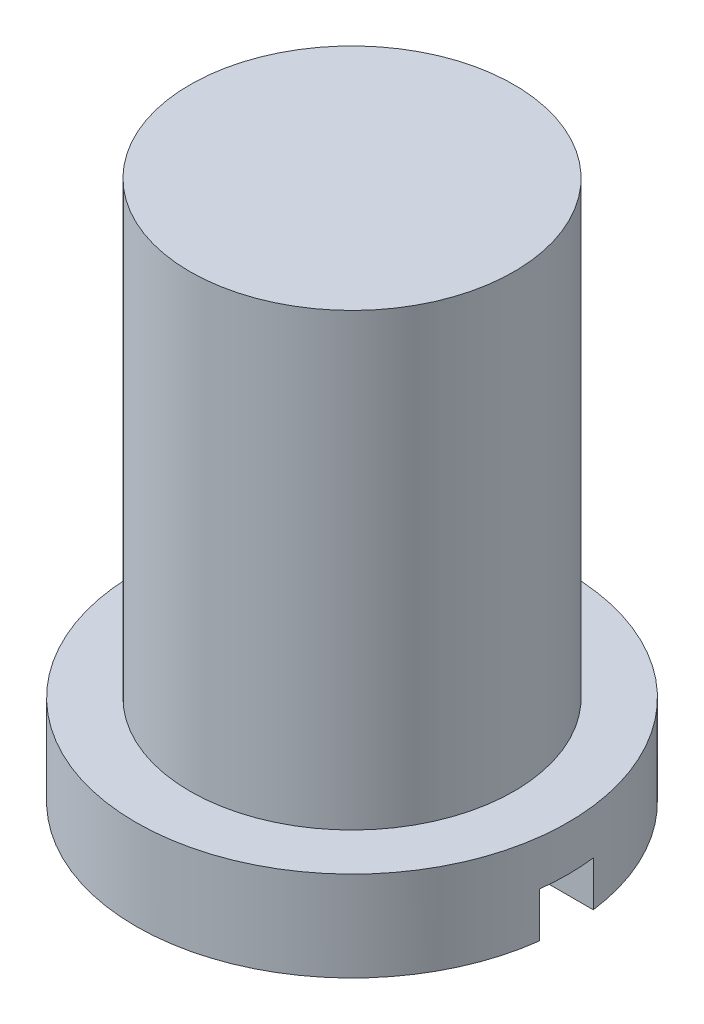
ISO-10303-21;
HEADER;
FILE_DESCRIPTION(('STEP AP214'),'2;1');
FILE_NAME('part.step','',(''),(''),'','','');
FILE_SCHEMA(('AUTOMOTIVE_DESIGN { 1 0 10303 214 1 1 1 1 }'));
ENDSEC;
DATA;
#1=APPLICATION_CONTEXT('core data for automotive mechanical design processes');
#2=APPLICATION_PROTOCOL_DEFINITION('international standard','automotive_design',2000,#1);
#3=PRODUCT_CONTEXT('',#1,'mechanical');
#4=PRODUCT('Part','Part','',(#3));
#5=PRODUCT_RELATED_PRODUCT_CATEGORY('part','',(#4));
#6=PRODUCT_DEFINITION_FORMATION('','',#4);
#7=PRODUCT_DEFINITION_CONTEXT('part definition',#1,'design');
#8=PRODUCT_DEFINITION('design','',#6,#7);
#9=PRODUCT_DEFINITION_SHAPE('','',#8);
#10=(LENGTH_UNIT() NAMED_UNIT(*) SI_UNIT(.MILLI.,.METRE.));
#11=(NAMED_UNIT(*) PLANE_ANGLE_UNIT() SI_UNIT($,.RADIAN.));
#12=(NAMED_UNIT(*) SI_UNIT($,.STERADIAN.) SOLID_ANGLE_UNIT());
#13=UNCERTAINTY_MEASURE_WITH_UNIT(LENGTH_MEASURE(1.E-05),#10,'distance_accuracy_value','');
#14=(GEOMETRIC_REPRESENTATION_CONTEXT(3) GLOBAL_UNCERTAINTY_ASSIGNED_CONTEXT((#13)) GLOBAL_UNIT_ASSIGNED_CONTEXT((#10,
#11,#12)) REPRESENTATION_CONTEXT('',''));
#15=CARTESIAN_POINT('',(0.,0.,0.));
#16=DIRECTION('',(0.,0.,1.));
#17=DIRECTION('',(1.,0.,0.));
#18=AXIS2_PLACEMENT_3D('',#15,#16,#17);
#19=CARTESIAN_POINT('',(0.,0.,0.));
#20=DIRECTION('',(0.,1.,0.));
#21=DIRECTION('',(0.,0.,1.));
#22=AXIS2_PLACEMENT_3D('',#19,#20,#21);
#23=PLANE('',#22);
#24=CARTESIAN_POINT('',(0.,0.,0.));
#25=DIRECTION('',(0.,1.,0.));
#26=DIRECTION('',(0.,0.,1.));
#27=AXIS2_PLACEMENT_3D('',#24,#25,#26);
#28=CIRCLE('',#27,2.4);
#29=CARTESIAN_POINT('',(-2.38153599290403,0.,0.297130130586936));
#30=VERTEX_POINT('',#29);
#31=CARTESIAN_POINT('',(2.38153599290403,0.,0.297130130586936));
#32=VERTEX_POINT('',#31);
#33=EDGE_CURVE('E97',#30,#32,#28,.T.);
#34=ORIENTED_EDGE('',*,*,#33,.F.);
#35=DIRECTION('',(1.,0.,0.));
#36=VECTOR('',#35,1.);
#37=CARTESIAN_POINT('',(0.,0.,0.297130130586936));
#38=LINE('',#37,#36);
#39=EDGE_CURVE('E85',#30,#32,#38,.T.);
#40=ORIENTED_EDGE('',*,*,#39,.T.);
#41=EDGE_LOOP('',(#34,#40));
#42=FACE_BOUND('',#41,.T.);
#43=ADVANCED_FACE('F37',(#42),#23,.F.);
#44=CARTESIAN_POINT('',(0.,1.,0.));
#45=DIRECTION('',(0.,-1.,0.));
#46=DIRECTION('',(0.,0.,-1.));
#47=AXIS2_PLACEMENT_3D('',#44,#45,#46);
#48=CYLINDRICAL_SURFACE('',#47,2.4);
#49=ORIENTED_EDGE('',*,*,#33,.T.);
#50=DIRECTION('',(0.,-1.,0.));
#51=VECTOR('',#50,1.);
#52=CARTESIAN_POINT('',(2.38153599290403,1.,0.297130130586936));
#53=LINE('',#52,#51);
#54=CARTESIAN_POINT('',(2.38153599290403,0.5,0.297130130586936));
#55=VERTEX_POINT('',#54);
#56=EDGE_CURVE('E93',#32,#55,#53,.F.);
#57=ORIENTED_EDGE('',*,*,#56,.T.);
#58=CARTESIAN_POINT('',(0.,0.5,0.));
#59=DIRECTION('',(0.,1.,0.));
#60=DIRECTION('',(0.,0.,1.));
#61=AXIS2_PLACEMENT_3D('',#58,#59,#60);
#62=CIRCLE('',#61,2.4);
#63=CARTESIAN_POINT('',(2.38117617995813,0.5,-0.3));
#64=VERTEX_POINT('',#63);
#65=EDGE_CURVE('E11',#55,#64,#62,.T.);
#66=ORIENTED_EDGE('',*,*,#65,.T.);
#67=DIRECTION('',(0.,-1.,0.));
#68=VECTOR('',#67,1.);
#69=CARTESIAN_POINT('',(2.38117617995813,1.,-0.3));
#70=LINE('',#69,#68);
#71=CARTESIAN_POINT('',(2.38117617995813,0.,-0.3));
#72=VERTEX_POINT('',#71);
#73=EDGE_CURVE('E80',#64,#72,#70,.T.);
#74=ORIENTED_EDGE('',*,*,#73,.T.);
#75=CARTESIAN_POINT('',(-2.38117617995813,0.,-0.3));
#76=VERTEX_POINT('',#75);
#77=EDGE_CURVE('E91',#72,#76,#28,.T.);
#78=ORIENTED_EDGE('',*,*,#77,.T.);
#79=DIRECTION('',(0.,-1.,0.));
#80=VECTOR('',#79,1.);
#81=CARTESIAN_POINT('',(-2.38117617995813,1.,-0.3));
#82=LINE('',#81,#80);
#83=CARTESIAN_POINT('',(-2.38117617995813,0.5,-0.3));
#84=VERTEX_POINT('',#83);
#85=EDGE_CURVE('E52',#76,#84,#82,.F.);
#86=ORIENTED_EDGE('',*,*,#85,.T.);
#87=CARTESIAN_POINT('',(-2.38153599290403,0.5,0.297130130586936));
#88=VERTEX_POINT('',#87);
#89=EDGE_CURVE('E41',#84,#88,#62,.T.);
#90=ORIENTED_EDGE('',*,*,#89,.T.);
#91=DIRECTION('',(0.,-1.,0.));
#92=VECTOR('',#91,1.);
#93=CARTESIAN_POINT('',(-2.38153599290403,1.,0.297130130586936));
#94=LINE('',#93,#92);
#95=EDGE_CURVE('E60',#88,#30,#94,.T.);
#96=ORIENTED_EDGE('',*,*,#95,.T.);
#97=EDGE_LOOP('',(#49,#57,#66,#74,#78,#86,#90,#96));
#98=FACE_BOUND('',#97,.T.);
#99=CARTESIAN_POINT('',(0.,1.,0.));
#100=DIRECTION('',(0.,1.,0.));
#101=DIRECTION('',(0.,0.,1.));
#102=AXIS2_PLACEMENT_3D('',#99,#100,#101);
#103=CIRCLE('',#102,2.4);
#104=CARTESIAN_POINT('',(0.,1.,2.4));
#105=VERTEX_POINT('',#104);
#106=EDGE_CURVE('E96',#105,#105,#103,.T.);
#107=ORIENTED_EDGE('',*,*,#106,.F.);
#108=EDGE_LOOP('',(#107));
#109=FACE_BOUND('',#108,.T.);
#110=ADVANCED_FACE('F39',(#98,#109),#48,.T.);
#111=CARTESIAN_POINT('',(0.,1.,0.));
#112=DIRECTION('',(0.,1.,0.));
#113=DIRECTION('',(0.,0.,1.));
#114=AXIS2_PLACEMENT_3D('',#111,#112,#113);
#115=PLANE('',#114);
#116=CARTESIAN_POINT('',(0.,1.,0.));
#117=DIRECTION('',(0.,1.,0.));
#118=DIRECTION('',(0.,0.,1.));
#119=AXIS2_PLACEMENT_3D('',#116,#117,#118);
#120=CIRCLE('',#119,1.8);
#121=CARTESIAN_POINT('',(0.,1.,1.8));
#122=VERTEX_POINT('',#121);
#123=EDGE_CURVE('E86',#122,#122,#120,.T.);
#124=ORIENTED_EDGE('',*,*,#123,.F.);
#125=EDGE_LOOP('',(#124));
#126=FACE_BOUND('',#125,.T.);
#127=ORIENTED_EDGE('',*,*,#106,.T.);
#128=EDGE_LOOP('',(#127));
#129=FACE_BOUND('',#128,.T.);
#130=ADVANCED_FACE('F123',(#126,#129),#115,.T.);
#131=ORIENTED_EDGE('',*,*,#77,.F.);
#132=DIRECTION('',(-1.,0.,0.));
#133=VECTOR('',#132,1.);
#134=CARTESIAN_POINT('',(0.,0.,-0.3));
#135=LINE('',#134,#133);
#136=EDGE_CURVE('E77',#72,#76,#135,.T.);
#137=ORIENTED_EDGE('',*,*,#136,.T.);
#138=EDGE_LOOP('',(#131,#137));
#139=FACE_BOUND('',#138,.T.);
#140=ADVANCED_FACE('F95',(#139),#23,.F.);
#141=CARTESIAN_POINT('',(0.,6.,0.));
#142=DIRECTION('',(0.,-1.,0.));
#143=DIRECTION('',(0.,0.,-1.));
#144=AXIS2_PLACEMENT_3D('',#141,#142,#143);
#145=CYLINDRICAL_SURFACE('',#144,1.8);
#146=CARTESIAN_POINT('',(0.,6.,0.));
#147=DIRECTION('',(0.,1.,0.));
#148=DIRECTION('',(0.,0.,1.));
#149=AXIS2_PLACEMENT_3D('',#146,#147,#148);
#150=CIRCLE('',#149,1.8);
#151=CARTESIAN_POINT('',(0.,6.,1.8));
#152=VERTEX_POINT('',#151);
#153=EDGE_CURVE('E101',#152,#152,#150,.T.);
#154=ORIENTED_EDGE('',*,*,#153,.F.);
#155=EDGE_LOOP('',(#154));
#156=FACE_BOUND('',#155,.T.);
#157=ORIENTED_EDGE('',*,*,#123,.T.);
#158=EDGE_LOOP('',(#157));
#159=FACE_BOUND('',#158,.T.);
#160=ADVANCED_FACE('F121',(#156,#159),#145,.T.);
#161=CARTESIAN_POINT('',(0.,6.,0.));
#162=DIRECTION('',(0.,1.,0.));
#163=DIRECTION('',(0.,0.,1.));
#164=AXIS2_PLACEMENT_3D('',#161,#162,#163);
#165=PLANE('',#164);
#166=ORIENTED_EDGE('',*,*,#153,.T.);
#167=EDGE_LOOP('',(#166));
#168=FACE_BOUND('',#167,.T.);
#169=ADVANCED_FACE('F138',(#168),#165,.T.);
#170=CARTESIAN_POINT('',(0.,0.5,0.));
#171=DIRECTION('',(0.,1.,0.));
#172=DIRECTION('',(0.,0.,1.));
#173=AXIS2_PLACEMENT_3D('',#170,#171,#172);
#174=PLANE('',#173);
#175=DIRECTION('',(-1.,0.,0.));
#176=VECTOR('',#175,1.);
#177=CARTESIAN_POINT('',(-2.4,0.5,0.297130130586936));
#178=LINE('',#177,#176);
#179=EDGE_CURVE('E110',#55,#88,#178,.T.);
#180=ORIENTED_EDGE('',*,*,#179,.T.);
#181=ORIENTED_EDGE('',*,*,#89,.F.);
#182=DIRECTION('',(1.,0.,0.));
#183=VECTOR('',#182,1.);
#184=CARTESIAN_POINT('',(2.4,0.5,-0.3));
#185=LINE('',#184,#183);
#186=EDGE_CURVE('E109',#84,#64,#185,.T.);
#187=ORIENTED_EDGE('',*,*,#186,.T.);
#188=ORIENTED_EDGE('',*,*,#65,.F.);
#189=EDGE_LOOP('',(#180,#181,#187,#188));
#190=FACE_BOUND('',#189,.T.);
#191=ADVANCED_FACE('F108',(#190),#174,.F.);
#192=CARTESIAN_POINT('',(-2.4,0.5,0.297130130586936));
#193=DIRECTION('',(0.,0.,1.));
#194=DIRECTION('',(1.,0.,0.));
#195=AXIS2_PLACEMENT_3D('',#192,#193,#194);
#196=PLANE('',#195);
#197=ORIENTED_EDGE('',*,*,#179,.F.);
#198=ORIENTED_EDGE('',*,*,#56,.F.);
#199=ORIENTED_EDGE('',*,*,#39,.F.);
#200=ORIENTED_EDGE('',*,*,#95,.F.);
#201=EDGE_LOOP('',(#197,#198,#199,#200));
#202=FACE_BOUND('',#201,.T.);
#203=ADVANCED_FACE('F150',(#202),#196,.F.);
#204=CARTESIAN_POINT('',(2.4,0.5,-0.3));
#205=DIRECTION('',(0.,0.,-1.));
#206=DIRECTION('',(-1.,0.,0.));
#207=AXIS2_PLACEMENT_3D('',#204,#205,#206);
#208=PLANE('',#207);
#209=ORIENTED_EDGE('',*,*,#186,.F.);
#210=ORIENTED_EDGE('',*,*,#85,.F.);
#211=ORIENTED_EDGE('',*,*,#136,.F.);
#212=ORIENTED_EDGE('',*,*,#73,.F.);
#213=EDGE_LOOP('',(#209,#210,#211,#212));
#214=FACE_BOUND('',#213,.T.);
#215=ADVANCED_FACE('F79',(#214),#208,.F.);
#216=CLOSED_SHELL('',(#43,#110,#130,#140,#160,#169,#191,#203,#215));
#217=MANIFOLD_SOLID_BREP('B2',#216);
#218=ADVANCED_BREP_SHAPE_REPRESENTATION('',(#18,#217),#14);
#219=SHAPE_DEFINITION_REPRESENTATION(#9,#218);
ENDSEC;
END-ISO-10303-21;
